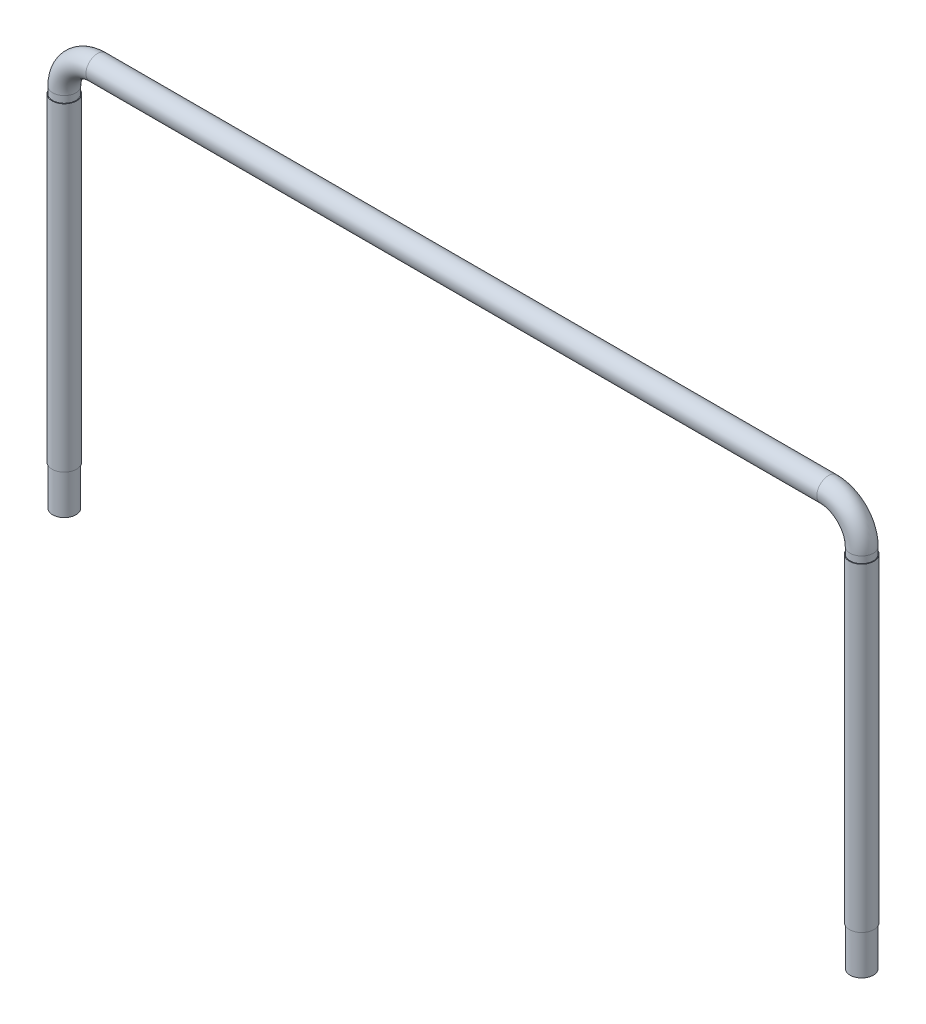
ISO-10303-21;
HEADER;
FILE_DESCRIPTION(('STEP AP214'),'2;1');
FILE_NAME('part.step','',(''),(''),'','','');
FILE_SCHEMA(('AUTOMOTIVE_DESIGN { 1 0 10303 214 1 1 1 1 }'));
ENDSEC;
DATA;
#1=APPLICATION_CONTEXT('core data for automotive mechanical design processes');
#2=APPLICATION_PROTOCOL_DEFINITION('international standard','automotive_design',2000,#1);
#3=PRODUCT_CONTEXT('',#1,'mechanical');
#4=PRODUCT('Part','Part','',(#3));
#5=PRODUCT_RELATED_PRODUCT_CATEGORY('part','',(#4));
#6=PRODUCT_DEFINITION_FORMATION('','',#4);
#7=PRODUCT_DEFINITION_CONTEXT('part definition',#1,'design');
#8=PRODUCT_DEFINITION('design','',#6,#7);
#9=PRODUCT_DEFINITION_SHAPE('','',#8);
#10=(LENGTH_UNIT() NAMED_UNIT(*) SI_UNIT(.MILLI.,.METRE.));
#11=(NAMED_UNIT(*) PLANE_ANGLE_UNIT() SI_UNIT($,.RADIAN.));
#12=(NAMED_UNIT(*) SI_UNIT($,.STERADIAN.) SOLID_ANGLE_UNIT());
#13=UNCERTAINTY_MEASURE_WITH_UNIT(LENGTH_MEASURE(1.E-05),#10,'distance_accuracy_value','');
#14=(GEOMETRIC_REPRESENTATION_CONTEXT(3) GLOBAL_UNCERTAINTY_ASSIGNED_CONTEXT((#13)) GLOBAL_UNIT_ASSIGNED_CONTEXT((#10,
#11,#12)) REPRESENTATION_CONTEXT('',''));
#15=CARTESIAN_POINT('',(0.,0.,0.));
#16=DIRECTION('',(0.,0.,1.));
#17=DIRECTION('',(1.,0.,0.));
#18=AXIS2_PLACEMENT_3D('',#15,#16,#17);
#19=CARTESIAN_POINT('',(-1524.,0.,0.));
#20=DIRECTION('',(0.,1.,0.));
#21=DIRECTION('',(-1.,0.,0.));
#22=AXIS2_PLACEMENT_3D('',#19,#20,#21);
#23=CYLINDRICAL_SURFACE('',#22,44.45);
#24=CARTESIAN_POINT('',(-1524.,1397.,0.));
#25=DIRECTION('',(0.,1.,0.));
#26=DIRECTION('',(0.,0.,1.));
#27=AXIS2_PLACEMENT_3D('',#24,#25,#26);
#28=CIRCLE('',#27,44.45);
#29=CARTESIAN_POINT('',(-1568.45,1397.,0.));
#30=VERTEX_POINT('',#29);
#31=EDGE_CURVE('E67',#30,#30,#28,.T.);
#32=ORIENTED_EDGE('',*,*,#31,.F.);
#33=EDGE_LOOP('',(#32));
#34=FACE_BOUND('',#33,.T.);
#35=CARTESIAN_POINT('',(-1524.,1371.6,0.));
#36=DIRECTION('',(0.,-1.,0.));
#37=DIRECTION('',(0.,0.,-1.));
#38=AXIS2_PLACEMENT_3D('',#35,#36,#37);
#39=CIRCLE('',#38,44.45);
#40=CARTESIAN_POINT('',(-1524.,1371.6,-44.45));
#41=VERTEX_POINT('',#40);
#42=EDGE_CURVE('E39',#41,#41,#39,.F.);
#43=ORIENTED_EDGE('',*,*,#42,.T.);
#44=EDGE_LOOP('',(#43));
#45=FACE_BOUND('',#44,.T.);
#46=ADVANCED_FACE('F35',(#34,#45),#23,.T.);
#47=CARTESIAN_POINT('',(1524.,1397.,0.));
#48=DIRECTION('',(0.,-1.,0.));
#49=DIRECTION('',(1.,0.,0.));
#50=AXIS2_PLACEMENT_3D('',#47,#48,#49);
#51=CYLINDRICAL_SURFACE('',#50,44.45);
#52=CARTESIAN_POINT('',(1524.,1397.,0.));
#53=DIRECTION('',(0.,-1.,0.));
#54=DIRECTION('',(0.,0.,1.));
#55=AXIS2_PLACEMENT_3D('',#52,#53,#54);
#56=CIRCLE('',#55,44.45);
#57=CARTESIAN_POINT('',(1568.45,1397.,0.));
#58=VERTEX_POINT('',#57);
#59=EDGE_CURVE('E58',#58,#58,#56,.T.);
#60=ORIENTED_EDGE('',*,*,#59,.T.);
#61=EDGE_LOOP('',(#60));
#62=FACE_BOUND('',#61,.T.);
#63=CARTESIAN_POINT('',(1524.,1371.6,0.));
#64=DIRECTION('',(0.,-1.,0.));
#65=DIRECTION('',(0.,0.,-1.));
#66=AXIS2_PLACEMENT_3D('',#63,#64,#65);
#67=CIRCLE('',#66,44.45);
#68=CARTESIAN_POINT('',(1524.,1371.6,-44.45));
#69=VERTEX_POINT('',#68);
#70=EDGE_CURVE('E50',#69,#69,#67,.F.);
#71=ORIENTED_EDGE('',*,*,#70,.T.);
#72=EDGE_LOOP('',(#71));
#73=FACE_BOUND('',#72,.T.);
#74=ADVANCED_FACE('F102',(#62,#73),#51,.T.);
#75=CARTESIAN_POINT('',(-1397.,1397.,0.));
#76=DIRECTION('',(0.,0.,-1.));
#77=DIRECTION('',(-1.,0.,0.));
#78=AXIS2_PLACEMENT_3D('',#75,#76,#77);
#79=TOROIDAL_SURFACE('',#78,127.,44.45);
#80=CARTESIAN_POINT('',(-1397.,1524.,0.));
#81=DIRECTION('',(1.,0.,0.));
#82=DIRECTION('',(0.,0.,1.));
#83=AXIS2_PLACEMENT_3D('',#80,#81,#82);
#84=CIRCLE('',#83,44.45);
#85=CARTESIAN_POINT('',(-1397.,1568.45,0.));
#86=VERTEX_POINT('',#85);
#87=EDGE_CURVE('E64',#86,#86,#84,.T.);
#88=CARTESIAN_POINT('',(-1397.,1397.,0.));
#89=DIRECTION('',(0.,0.,-1.));
#90=DIRECTION('',(-1.,0.,0.));
#91=AXIS2_PLACEMENT_3D('',#88,#89,#90);
#92=CIRCLE('',#91,171.45);
#93=EDGE_CURVE('',#30,#86,#92,.T.);
#94=ORIENTED_EDGE('',*,*,#31,.T.);
#95=ORIENTED_EDGE('',*,*,#87,.F.);
#96=ORIENTED_EDGE('',*,*,#93,.T.);
#97=ORIENTED_EDGE('',*,*,#93,.F.);
#98=EDGE_LOOP('',(#94,#96,#95,#97));
#99=FACE_BOUND('',#98,.T.);
#100=ADVANCED_FACE('F109',(#99),#79,.T.);
#101=CARTESIAN_POINT('',(-1397.,1524.,0.));
#102=DIRECTION('',(1.,0.,0.));
#103=DIRECTION('',(0.,0.,-1.));
#104=AXIS2_PLACEMENT_3D('',#101,#102,#103);
#105=CYLINDRICAL_SURFACE('',#104,44.45);
#106=CARTESIAN_POINT('',(1397.,1524.,0.));
#107=DIRECTION('',(1.,0.,0.));
#108=DIRECTION('',(0.,0.,1.));
#109=AXIS2_PLACEMENT_3D('',#106,#107,#108);
#110=CIRCLE('',#109,44.45);
#111=CARTESIAN_POINT('',(1397.,1568.45,0.));
#112=VERTEX_POINT('',#111);
#113=EDGE_CURVE('E61',#112,#112,#110,.T.);
#114=ORIENTED_EDGE('',*,*,#113,.F.);
#115=EDGE_LOOP('',(#114));
#116=FACE_BOUND('',#115,.T.);
#117=ORIENTED_EDGE('',*,*,#87,.T.);
#118=EDGE_LOOP('',(#117));
#119=FACE_BOUND('',#118,.T.);
#120=ADVANCED_FACE('F172',(#116,#119),#105,.T.);
#121=CARTESIAN_POINT('',(1397.,1397.,0.));
#122=DIRECTION('',(0.,0.,-1.));
#123=DIRECTION('',(-1.,0.,0.));
#124=AXIS2_PLACEMENT_3D('',#121,#122,#123);
#125=TOROIDAL_SURFACE('',#124,127.,44.45);
#126=CARTESIAN_POINT('',(1397.,1397.,0.));
#127=DIRECTION('',(0.,0.,-1.));
#128=DIRECTION('',(-1.,0.,0.));
#129=AXIS2_PLACEMENT_3D('',#126,#127,#128);
#130=CIRCLE('',#129,171.45);
#131=EDGE_CURVE('',#112,#58,#130,.T.);
#132=ORIENTED_EDGE('',*,*,#113,.T.);
#133=ORIENTED_EDGE('',*,*,#59,.F.);
#134=ORIENTED_EDGE('',*,*,#131,.T.);
#135=ORIENTED_EDGE('',*,*,#131,.F.);
#136=EDGE_LOOP('',(#132,#134,#133,#135));
#137=FACE_BOUND('',#136,.T.);
#138=ADVANCED_FACE('F112',(#137),#125,.T.);
#139=CARTESIAN_POINT('',(1524.,1371.6,0.));
#140=DIRECTION('',(0.,-1.,0.));
#141=DIRECTION('',(0.,0.,-1.));
#142=AXIS2_PLACEMENT_3D('',#139,#140,#141);
#143=CYLINDRICAL_SURFACE('',#142,46.9900000000001);
#144=CARTESIAN_POINT('',(1524.,1371.6,0.));
#145=DIRECTION('',(0.,-1.,0.));
#146=DIRECTION('',(0.,0.,-1.));
#147=AXIS2_PLACEMENT_3D('',#144,#145,#146);
#148=CIRCLE('',#147,46.9900000000001);
#149=CARTESIAN_POINT('',(1524.,1371.6,-46.9900000000001));
#150=VERTEX_POINT('',#149);
#151=EDGE_CURVE('E53',#150,#150,#148,.T.);
#152=ORIENTED_EDGE('',*,*,#151,.T.);
#153=EDGE_LOOP('',(#152));
#154=FACE_BOUND('',#153,.T.);
#155=CARTESIAN_POINT('',(1524.,152.4,0.));
#156=DIRECTION('',(0.,-1.,0.));
#157=DIRECTION('',(0.,0.,-1.));
#158=AXIS2_PLACEMENT_3D('',#155,#156,#157);
#159=CIRCLE('',#158,46.9900000000001);
#160=CARTESIAN_POINT('',(1524.,152.4,-46.9900000000001));
#161=VERTEX_POINT('',#160);
#162=EDGE_CURVE('E72',#161,#161,#159,.T.);
#163=ORIENTED_EDGE('',*,*,#162,.F.);
#164=EDGE_LOOP('',(#163));
#165=FACE_BOUND('',#164,.T.);
#166=ADVANCED_FACE('F171',(#154,#165),#143,.T.);
#167=CARTESIAN_POINT('',(1524.,1371.6,0.));
#168=DIRECTION('',(0.,-1.,0.));
#169=DIRECTION('',(0.,0.,-1.));
#170=AXIS2_PLACEMENT_3D('',#167,#168,#169);
#171=PLANE('',#170);
#172=ORIENTED_EDGE('',*,*,#70,.F.);
#173=EDGE_LOOP('',(#172));
#174=FACE_BOUND('',#173,.T.);
#175=ORIENTED_EDGE('',*,*,#151,.F.);
#176=EDGE_LOOP('',(#175));
#177=FACE_BOUND('',#176,.T.);
#178=ADVANCED_FACE('F218',(#174,#177),#171,.F.);
#179=CARTESIAN_POINT('',(1524.,152.4,0.));
#180=DIRECTION('',(0.,-1.,0.));
#181=DIRECTION('',(0.,0.,-1.));
#182=AXIS2_PLACEMENT_3D('',#179,#180,#181);
#183=PLANE('',#182);
#184=CARTESIAN_POINT('',(1524.,152.4,0.));
#185=DIRECTION('',(0.,-1.,0.));
#186=DIRECTION('',(0.,0.,-1.));
#187=AXIS2_PLACEMENT_3D('',#184,#185,#186);
#188=CIRCLE('',#187,44.45);
#189=CARTESIAN_POINT('',(1524.,152.4,-44.45));
#190=VERTEX_POINT('',#189);
#191=EDGE_CURVE('E43',#190,#190,#188,.F.);
#192=ORIENTED_EDGE('',*,*,#191,.T.);
#193=EDGE_LOOP('',(#192));
#194=FACE_BOUND('',#193,.T.);
#195=ORIENTED_EDGE('',*,*,#162,.T.);
#196=EDGE_LOOP('',(#195));
#197=FACE_BOUND('',#196,.T.);
#198=ADVANCED_FACE('F200',(#194,#197),#183,.T.);
#199=CARTESIAN_POINT('',(1524.,-4.84460956200068E-13,0.));
#200=DIRECTION('',(0.,-1.,0.));
#201=DIRECTION('',(0.,0.,1.));
#202=AXIS2_PLACEMENT_3D('',#199,#200,#201);
#203=PLANE('',#202);
#204=CARTESIAN_POINT('',(1524.,-4.84460956200068E-13,0.));
#205=DIRECTION('',(0.,-1.,0.));
#206=DIRECTION('',(0.,0.,1.));
#207=AXIS2_PLACEMENT_3D('',#204,#205,#206);
#208=CIRCLE('',#207,44.45);
#209=CARTESIAN_POINT('',(1524.,-4.84460956200068E-13,44.45));
#210=VERTEX_POINT('',#209);
#211=EDGE_CURVE('E47',#210,#210,#208,.T.);
#212=ORIENTED_EDGE('',*,*,#211,.T.);
#213=EDGE_LOOP('',(#212));
#214=FACE_BOUND('',#213,.T.);
#215=ADVANCED_FACE('F151',(#214),#203,.T.);
#216=ORIENTED_EDGE('',*,*,#191,.F.);
#217=EDGE_LOOP('',(#216));
#218=FACE_BOUND('',#217,.T.);
#219=ORIENTED_EDGE('',*,*,#211,.F.);
#220=EDGE_LOOP('',(#219));
#221=FACE_BOUND('',#220,.T.);
#222=ADVANCED_FACE('F99',(#218,#221),#51,.T.);
#223=CARTESIAN_POINT('',(-1524.,1371.6,0.));
#224=DIRECTION('',(0.,-1.,0.));
#225=DIRECTION('',(0.,0.,-1.));
#226=AXIS2_PLACEMENT_3D('',#223,#224,#225);
#227=CYLINDRICAL_SURFACE('',#226,46.9900000000001);
#228=CARTESIAN_POINT('',(-1524.,1371.6,0.));
#229=DIRECTION('',(0.,-1.,0.));
#230=DIRECTION('',(0.,0.,-1.));
#231=AXIS2_PLACEMENT_3D('',#228,#229,#230);
#232=CIRCLE('',#231,46.9900000000001);
#233=CARTESIAN_POINT('',(-1524.,1371.6,-46.9900000000001));
#234=VERTEX_POINT('',#233);
#235=EDGE_CURVE('E80',#234,#234,#232,.T.);
#236=ORIENTED_EDGE('',*,*,#235,.T.);
#237=EDGE_LOOP('',(#236));
#238=FACE_BOUND('',#237,.T.);
#239=CARTESIAN_POINT('',(-1524.,152.4,0.));
#240=DIRECTION('',(0.,-1.,0.));
#241=DIRECTION('',(0.,0.,-1.));
#242=AXIS2_PLACEMENT_3D('',#239,#240,#241);
#243=CIRCLE('',#242,46.9900000000001);
#244=CARTESIAN_POINT('',(-1524.,152.4,-46.9900000000001));
#245=VERTEX_POINT('',#244);
#246=EDGE_CURVE('E77',#245,#245,#243,.T.);
#247=ORIENTED_EDGE('',*,*,#246,.F.);
#248=EDGE_LOOP('',(#247));
#249=FACE_BOUND('',#248,.T.);
#250=ADVANCED_FACE('F92',(#238,#249),#227,.T.);
#251=CARTESIAN_POINT('',(-1524.,1371.6,0.));
#252=DIRECTION('',(0.,-1.,0.));
#253=DIRECTION('',(0.,0.,-1.));
#254=AXIS2_PLACEMENT_3D('',#251,#252,#253);
#255=PLANE('',#254);
#256=ORIENTED_EDGE('',*,*,#42,.F.);
#257=EDGE_LOOP('',(#256));
#258=FACE_BOUND('',#257,.T.);
#259=ORIENTED_EDGE('',*,*,#235,.F.);
#260=EDGE_LOOP('',(#259));
#261=FACE_BOUND('',#260,.T.);
#262=ADVANCED_FACE('F88',(#258,#261),#255,.F.);
#263=CARTESIAN_POINT('',(-1524.,152.4,0.));
#264=DIRECTION('',(0.,-1.,0.));
#265=DIRECTION('',(0.,0.,-1.));
#266=AXIS2_PLACEMENT_3D('',#263,#264,#265);
#267=PLANE('',#266);
#268=CARTESIAN_POINT('',(-1524.,152.4,0.));
#269=DIRECTION('',(0.,-1.,0.));
#270=DIRECTION('',(0.,0.,-1.));
#271=AXIS2_PLACEMENT_3D('',#268,#269,#270);
#272=CIRCLE('',#271,44.45);
#273=CARTESIAN_POINT('',(-1524.,152.4,-44.45));
#274=VERTEX_POINT('',#273);
#275=EDGE_CURVE('E10',#274,#274,#272,.F.);
#276=ORIENTED_EDGE('',*,*,#275,.T.);
#277=EDGE_LOOP('',(#276));
#278=FACE_BOUND('',#277,.T.);
#279=ORIENTED_EDGE('',*,*,#246,.T.);
#280=EDGE_LOOP('',(#279));
#281=FACE_BOUND('',#280,.T.);
#282=ADVANCED_FACE('F91',(#278,#281),#267,.T.);
#283=CARTESIAN_POINT('',(-1524.,0.,0.));
#284=DIRECTION('',(0.,1.,0.));
#285=DIRECTION('',(0.,0.,1.));
#286=AXIS2_PLACEMENT_3D('',#283,#284,#285);
#287=PLANE('',#286);
#288=CARTESIAN_POINT('',(-1524.,0.,0.));
#289=DIRECTION('',(0.,1.,0.));
#290=DIRECTION('',(0.,0.,1.));
#291=AXIS2_PLACEMENT_3D('',#288,#289,#290);
#292=CIRCLE('',#291,44.45);
#293=CARTESIAN_POINT('',(-1524.,0.,44.45));
#294=VERTEX_POINT('',#293);
#295=EDGE_CURVE('E52',#294,#294,#292,.T.);
#296=ORIENTED_EDGE('',*,*,#295,.F.);
#297=EDGE_LOOP('',(#296));
#298=FACE_BOUND('',#297,.T.);
#299=ADVANCED_FACE('F37',(#298),#287,.F.);
#300=ORIENTED_EDGE('',*,*,#275,.F.);
#301=EDGE_LOOP('',(#300));
#302=FACE_BOUND('',#301,.T.);
#303=ORIENTED_EDGE('',*,*,#295,.T.);
#304=EDGE_LOOP('',(#303));
#305=FACE_BOUND('',#304,.T.);
#306=ADVANCED_FACE('F105',(#302,#305),#23,.T.);
#307=CLOSED_SHELL('',(#46,#74,#100,#120,#138,#166,#178,#198,#215,#222,#250,#262,#282,#299,#306));
#308=MANIFOLD_SOLID_BREP('B2',#307);
#309=ADVANCED_BREP_SHAPE_REPRESENTATION('',(#18,#308),#14);
#310=SHAPE_DEFINITION_REPRESENTATION(#9,#309);
ENDSEC;
END-ISO-10303-21;
